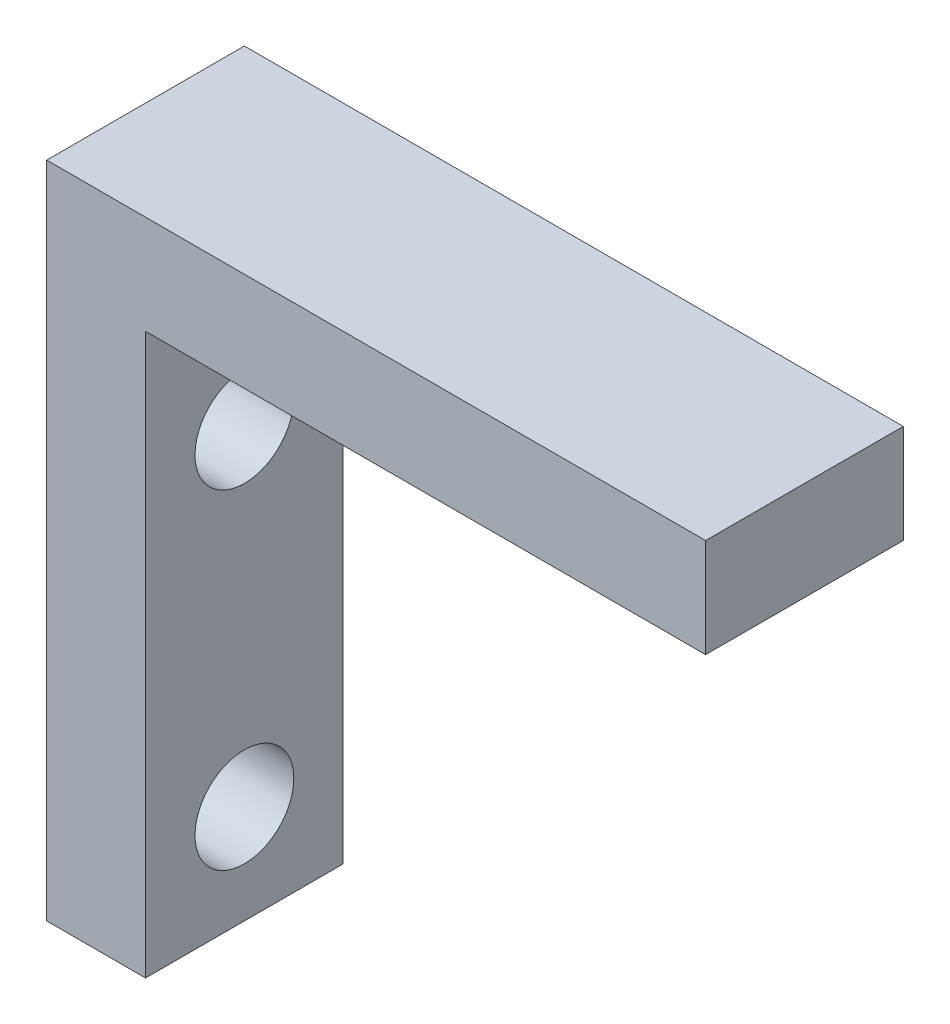
ISO-10303-21;
HEADER;
FILE_DESCRIPTION(('STEP AP214'),'2;1');
FILE_NAME('part.step','',(''),(''),'','','');
FILE_SCHEMA(('AUTOMOTIVE_DESIGN { 1 0 10303 214 1 1 1 1 }'));
ENDSEC;
DATA;
#1=APPLICATION_CONTEXT('core data for automotive mechanical design processes');
#2=APPLICATION_PROTOCOL_DEFINITION('international standard','automotive_design',2000,#1);
#3=PRODUCT_CONTEXT('',#1,'mechanical');
#4=PRODUCT('Part','Part','',(#3));
#5=PRODUCT_RELATED_PRODUCT_CATEGORY('part','',(#4));
#6=PRODUCT_DEFINITION_FORMATION('','',#4);
#7=PRODUCT_DEFINITION_CONTEXT('part definition',#1,'design');
#8=PRODUCT_DEFINITION('design','',#6,#7);
#9=PRODUCT_DEFINITION_SHAPE('','',#8);
#10=(LENGTH_UNIT() NAMED_UNIT(*) SI_UNIT(.MILLI.,.METRE.));
#11=(NAMED_UNIT(*) PLANE_ANGLE_UNIT() SI_UNIT($,.RADIAN.));
#12=(NAMED_UNIT(*) SI_UNIT($,.STERADIAN.) SOLID_ANGLE_UNIT());
#13=UNCERTAINTY_MEASURE_WITH_UNIT(LENGTH_MEASURE(1.E-05),#10,'distance_accuracy_value','');
#14=(GEOMETRIC_REPRESENTATION_CONTEXT(3) GLOBAL_UNCERTAINTY_ASSIGNED_CONTEXT((#13)) GLOBAL_UNIT_ASSIGNED_CONTEXT((#10,
#11,#12)) REPRESENTATION_CONTEXT('',''));
#15=CARTESIAN_POINT('',(0.,0.,0.));
#16=DIRECTION('',(0.,0.,1.));
#17=DIRECTION('',(1.,0.,0.));
#18=AXIS2_PLACEMENT_3D('',#15,#16,#17);
#19=CARTESIAN_POINT('',(0.,-3.,6.));
#20=DIRECTION('',(-1.,0.,0.));
#21=DIRECTION('',(0.,0.,1.));
#22=AXIS2_PLACEMENT_3D('',#19,#20,#21);
#23=PLANE('',#22);
#24=DIRECTION('',(0.,1.,0.));
#25=VECTOR('',#24,1.);
#26=CARTESIAN_POINT('',(0.,-3.,0.));
#27=LINE('',#26,#25);
#28=CARTESIAN_POINT('',(0.,-3.,0.));
#29=VERTEX_POINT('',#28);
#30=CARTESIAN_POINT('',(0.,0.,0.));
#31=VERTEX_POINT('',#30);
#32=EDGE_CURVE('E117',#29,#31,#27,.T.);
#33=ORIENTED_EDGE('',*,*,#32,.T.);
#34=DIRECTION('',(0.,0.,-1.));
#35=VECTOR('',#34,1.);
#36=CARTESIAN_POINT('',(0.,0.,6.));
#37=LINE('',#36,#35);
#38=CARTESIAN_POINT('',(0.,0.,6.));
#39=VERTEX_POINT('',#38);
#40=EDGE_CURVE('E11',#39,#31,#37,.T.);
#41=ORIENTED_EDGE('',*,*,#40,.F.);
#42=DIRECTION('',(0.,1.,0.));
#43=VECTOR('',#42,1.);
#44=CARTESIAN_POINT('',(0.,-3.,6.));
#45=LINE('',#44,#43);
#46=CARTESIAN_POINT('',(0.,-3.,6.));
#47=VERTEX_POINT('',#46);
#48=EDGE_CURVE('E128',#47,#39,#45,.T.);
#49=ORIENTED_EDGE('',*,*,#48,.F.);
#50=DIRECTION('',(0.,0.,-1.));
#51=VECTOR('',#50,1.);
#52=CARTESIAN_POINT('',(0.,-3.,6.));
#53=LINE('',#52,#51);
#54=EDGE_CURVE('E113',#47,#29,#53,.T.);
#55=ORIENTED_EDGE('',*,*,#54,.T.);
#56=EDGE_LOOP('',(#33,#41,#49,#55));
#57=FACE_BOUND('',#56,.T.);
#58=ADVANCED_FACE('F33',(#57),#23,.F.);
#59=CARTESIAN_POINT('',(0.,0.,6.));
#60=DIRECTION('',(0.,-1.,0.));
#61=DIRECTION('',(0.,0.,-1.));
#62=AXIS2_PLACEMENT_3D('',#59,#60,#61);
#63=PLANE('',#62);
#64=DIRECTION('',(-1.,0.,0.));
#65=VECTOR('',#64,1.);
#66=CARTESIAN_POINT('',(0.,0.,0.));
#67=LINE('',#66,#65);
#68=CARTESIAN_POINT('',(-20.,0.,0.));
#69=VERTEX_POINT('',#68);
#70=EDGE_CURVE('E120',#31,#69,#67,.T.);
#71=ORIENTED_EDGE('',*,*,#70,.T.);
#72=DIRECTION('',(0.,0.,-1.));
#73=VECTOR('',#72,1.);
#74=CARTESIAN_POINT('',(-20.,0.,6.));
#75=LINE('',#74,#73);
#76=CARTESIAN_POINT('',(-20.,0.,6.));
#77=VERTEX_POINT('',#76);
#78=EDGE_CURVE('E41',#77,#69,#75,.T.);
#79=ORIENTED_EDGE('',*,*,#78,.F.);
#80=DIRECTION('',(-1.,0.,0.));
#81=VECTOR('',#80,1.);
#82=CARTESIAN_POINT('',(0.,0.,6.));
#83=LINE('',#82,#81);
#84=EDGE_CURVE('E86',#39,#77,#83,.T.);
#85=ORIENTED_EDGE('',*,*,#84,.F.);
#86=ORIENTED_EDGE('',*,*,#40,.T.);
#87=EDGE_LOOP('',(#71,#79,#85,#86));
#88=FACE_BOUND('',#87,.T.);
#89=ADVANCED_FACE('F153',(#88),#63,.F.);
#90=CARTESIAN_POINT('',(-20.,0.,6.));
#91=DIRECTION('',(1.,0.,0.));
#92=DIRECTION('',(0.,1.,0.));
#93=AXIS2_PLACEMENT_3D('',#90,#91,#92);
#94=PLANE('',#93);
#95=CARTESIAN_POINT('',(-20.,-7.,3.));
#96=DIRECTION('',(-1.,0.,0.));
#97=DIRECTION('',(0.,-1.,0.));
#98=AXIS2_PLACEMENT_3D('',#95,#96,#97);
#99=CIRCLE('',#98,1.5);
#100=CARTESIAN_POINT('',(-20.,-8.5,3.));
#101=VERTEX_POINT('',#100);
#102=EDGE_CURVE('E220',#101,#101,#99,.T.);
#103=ORIENTED_EDGE('',*,*,#102,.F.);
#104=EDGE_LOOP('',(#103));
#105=FACE_BOUND('',#104,.T.);
#106=CARTESIAN_POINT('',(-20.,-17.,3.));
#107=DIRECTION('',(-1.,0.,0.));
#108=DIRECTION('',(0.,-1.,0.));
#109=AXIS2_PLACEMENT_3D('',#106,#107,#108);
#110=CIRCLE('',#109,1.5);
#111=CARTESIAN_POINT('',(-20.,-18.5,3.));
#112=VERTEX_POINT('',#111);
#113=EDGE_CURVE('E225',#112,#112,#110,.T.);
#114=ORIENTED_EDGE('',*,*,#113,.F.);
#115=EDGE_LOOP('',(#114));
#116=FACE_BOUND('',#115,.T.);
#117=DIRECTION('',(0.,-1.,0.));
#118=VECTOR('',#117,1.);
#119=CARTESIAN_POINT('',(-20.,0.,0.));
#120=LINE('',#119,#118);
#121=CARTESIAN_POINT('',(-20.,-20.,0.));
#122=VERTEX_POINT('',#121);
#123=EDGE_CURVE('E123',#69,#122,#120,.T.);
#124=ORIENTED_EDGE('',*,*,#123,.T.);
#125=DIRECTION('',(0.,0.,-1.));
#126=VECTOR('',#125,1.);
#127=CARTESIAN_POINT('',(-20.,-20.,6.));
#128=LINE('',#127,#126);
#129=CARTESIAN_POINT('',(-20.,-20.,6.));
#130=VERTEX_POINT('',#129);
#131=EDGE_CURVE('E108',#130,#122,#128,.T.);
#132=ORIENTED_EDGE('',*,*,#131,.F.);
#133=DIRECTION('',(0.,-1.,0.));
#134=VECTOR('',#133,1.);
#135=CARTESIAN_POINT('',(-20.,0.,6.));
#136=LINE('',#135,#134);
#137=EDGE_CURVE('E99',#77,#130,#136,.T.);
#138=ORIENTED_EDGE('',*,*,#137,.F.);
#139=ORIENTED_EDGE('',*,*,#78,.T.);
#140=EDGE_LOOP('',(#124,#132,#138,#139));
#141=FACE_BOUND('',#140,.T.);
#142=ADVANCED_FACE('F134',(#105,#116,#141),#94,.F.);
#143=CARTESIAN_POINT('',(-20.,-20.,6.));
#144=DIRECTION('',(0.,1.,0.));
#145=DIRECTION('',(0.,0.,1.));
#146=AXIS2_PLACEMENT_3D('',#143,#144,#145);
#147=PLANE('',#146);
#148=DIRECTION('',(1.,0.,0.));
#149=VECTOR('',#148,1.);
#150=CARTESIAN_POINT('',(-20.,-20.,0.));
#151=LINE('',#150,#149);
#152=CARTESIAN_POINT('',(-17.,-20.,0.));
#153=VERTEX_POINT('',#152);
#154=EDGE_CURVE('E107',#122,#153,#151,.T.);
#155=ORIENTED_EDGE('',*,*,#154,.T.);
#156=DIRECTION('',(0.,0.,-1.));
#157=VECTOR('',#156,1.);
#158=CARTESIAN_POINT('',(-17.,-20.,6.));
#159=LINE('',#158,#157);
#160=CARTESIAN_POINT('',(-17.,-20.,6.));
#161=VERTEX_POINT('',#160);
#162=EDGE_CURVE('E104',#161,#153,#159,.T.);
#163=ORIENTED_EDGE('',*,*,#162,.F.);
#164=DIRECTION('',(1.,0.,0.));
#165=VECTOR('',#164,1.);
#166=CARTESIAN_POINT('',(-20.,-20.,6.));
#167=LINE('',#166,#165);
#168=EDGE_CURVE('E93',#130,#161,#167,.T.);
#169=ORIENTED_EDGE('',*,*,#168,.F.);
#170=ORIENTED_EDGE('',*,*,#131,.T.);
#171=EDGE_LOOP('',(#155,#163,#169,#170));
#172=FACE_BOUND('',#171,.T.);
#173=ADVANCED_FACE('F105',(#172),#147,.F.);
#174=CARTESIAN_POINT('',(-17.,-20.,6.));
#175=DIRECTION('',(-1.,0.,0.));
#176=DIRECTION('',(0.,0.,1.));
#177=AXIS2_PLACEMENT_3D('',#174,#175,#176);
#178=PLANE('',#177);
#179=CARTESIAN_POINT('',(-17.,-7.,3.));
#180=DIRECTION('',(-1.,0.,0.));
#181=DIRECTION('',(0.,-1.,0.));
#182=AXIS2_PLACEMENT_3D('',#179,#180,#181);
#183=CIRCLE('',#182,1.5);
#184=CARTESIAN_POINT('',(-17.,-8.5,3.));
#185=VERTEX_POINT('',#184);
#186=EDGE_CURVE('E121',#185,#185,#183,.T.);
#187=ORIENTED_EDGE('',*,*,#186,.T.);
#188=EDGE_LOOP('',(#187));
#189=FACE_BOUND('',#188,.T.);
#190=CARTESIAN_POINT('',(-17.,-17.,3.));
#191=DIRECTION('',(-1.,0.,0.));
#192=DIRECTION('',(0.,-1.,0.));
#193=AXIS2_PLACEMENT_3D('',#190,#191,#192);
#194=CIRCLE('',#193,1.5);
#195=CARTESIAN_POINT('',(-17.,-18.5,3.));
#196=VERTEX_POINT('',#195);
#197=EDGE_CURVE('E221',#196,#196,#194,.T.);
#198=ORIENTED_EDGE('',*,*,#197,.T.);
#199=EDGE_LOOP('',(#198));
#200=FACE_BOUND('',#199,.T.);
#201=DIRECTION('',(0.,1.,0.));
#202=VECTOR('',#201,1.);
#203=CARTESIAN_POINT('',(-17.,-20.,0.));
#204=LINE('',#203,#202);
#205=CARTESIAN_POINT('',(-17.,-3.,0.));
#206=VERTEX_POINT('',#205);
#207=EDGE_CURVE('E72',#153,#206,#204,.T.);
#208=ORIENTED_EDGE('',*,*,#207,.T.);
#209=DIRECTION('',(0.,0.,-1.));
#210=VECTOR('',#209,1.);
#211=CARTESIAN_POINT('',(-17.,-3.,6.));
#212=LINE('',#211,#210);
#213=CARTESIAN_POINT('',(-17.,-3.,6.));
#214=VERTEX_POINT('',#213);
#215=EDGE_CURVE('E109',#214,#206,#212,.T.);
#216=ORIENTED_EDGE('',*,*,#215,.F.);
#217=DIRECTION('',(0.,1.,0.));
#218=VECTOR('',#217,1.);
#219=CARTESIAN_POINT('',(-17.,-20.,6.));
#220=LINE('',#219,#218);
#221=EDGE_CURVE('E97',#161,#214,#220,.T.);
#222=ORIENTED_EDGE('',*,*,#221,.F.);
#223=ORIENTED_EDGE('',*,*,#162,.T.);
#224=EDGE_LOOP('',(#208,#216,#222,#223));
#225=FACE_BOUND('',#224,.T.);
#226=ADVANCED_FACE('F111',(#189,#200,#225),#178,.F.);
#227=CARTESIAN_POINT('',(-17.,-3.,6.));
#228=DIRECTION('',(0.,1.,0.));
#229=DIRECTION('',(0.,0.,1.));
#230=AXIS2_PLACEMENT_3D('',#227,#228,#229);
#231=PLANE('',#230);
#232=DIRECTION('',(1.,0.,0.));
#233=VECTOR('',#232,1.);
#234=CARTESIAN_POINT('',(-17.,-3.,0.));
#235=LINE('',#234,#233);
#236=EDGE_CURVE('E78',#206,#29,#235,.T.);
#237=ORIENTED_EDGE('',*,*,#236,.T.);
#238=ORIENTED_EDGE('',*,*,#54,.F.);
#239=DIRECTION('',(1.,0.,0.));
#240=VECTOR('',#239,1.);
#241=CARTESIAN_POINT('',(-17.,-3.,6.));
#242=LINE('',#241,#240);
#243=EDGE_CURVE('E49',#214,#47,#242,.T.);
#244=ORIENTED_EDGE('',*,*,#243,.F.);
#245=ORIENTED_EDGE('',*,*,#215,.T.);
#246=EDGE_LOOP('',(#237,#238,#244,#245));
#247=FACE_BOUND('',#246,.T.);
#248=ADVANCED_FACE('F141',(#247),#231,.F.);
#249=CARTESIAN_POINT('',(0.,0.,6.));
#250=DIRECTION('',(0.,0.,1.));
#251=DIRECTION('',(1.,0.,0.));
#252=AXIS2_PLACEMENT_3D('',#249,#250,#251);
#253=PLANE('',#252);
#254=ORIENTED_EDGE('',*,*,#48,.T.);
#255=ORIENTED_EDGE('',*,*,#84,.T.);
#256=ORIENTED_EDGE('',*,*,#137,.T.);
#257=ORIENTED_EDGE('',*,*,#168,.T.);
#258=ORIENTED_EDGE('',*,*,#221,.T.);
#259=ORIENTED_EDGE('',*,*,#243,.T.);
#260=EDGE_LOOP('',(#254,#255,#256,#257,#258,#259));
#261=FACE_BOUND('',#260,.T.);
#262=ADVANCED_FACE('F95',(#261),#253,.T.);
#263=CARTESIAN_POINT('',(0.,0.,0.));
#264=DIRECTION('',(0.,0.,1.));
#265=DIRECTION('',(1.,0.,0.));
#266=AXIS2_PLACEMENT_3D('',#263,#264,#265);
#267=PLANE('',#266);
#268=ORIENTED_EDGE('',*,*,#32,.F.);
#269=ORIENTED_EDGE('',*,*,#236,.F.);
#270=ORIENTED_EDGE('',*,*,#207,.F.);
#271=ORIENTED_EDGE('',*,*,#154,.F.);
#272=ORIENTED_EDGE('',*,*,#123,.F.);
#273=ORIENTED_EDGE('',*,*,#70,.F.);
#274=EDGE_LOOP('',(#268,#269,#270,#271,#272,#273));
#275=FACE_BOUND('',#274,.T.);
#276=ADVANCED_FACE('F137',(#275),#267,.F.);
#277=CARTESIAN_POINT('',(-17.,-17.,3.));
#278=DIRECTION('',(-1.,0.,0.));
#279=DIRECTION('',(0.,-1.,0.));
#280=AXIS2_PLACEMENT_3D('',#277,#278,#279);
#281=CYLINDRICAL_SURFACE('',#280,1.5);
#282=ORIENTED_EDGE('',*,*,#197,.F.);
#283=EDGE_LOOP('',(#282));
#284=FACE_BOUND('',#283,.T.);
#285=ORIENTED_EDGE('',*,*,#113,.T.);
#286=EDGE_LOOP('',(#285));
#287=FACE_BOUND('',#286,.T.);
#288=ADVANCED_FACE('F181',(#284,#287),#281,.F.);
#289=CARTESIAN_POINT('',(-17.,-7.,3.));
#290=DIRECTION('',(-1.,0.,0.));
#291=DIRECTION('',(0.,-1.,0.));
#292=AXIS2_PLACEMENT_3D('',#289,#290,#291);
#293=CYLINDRICAL_SURFACE('',#292,1.5);
#294=ORIENTED_EDGE('',*,*,#186,.F.);
#295=EDGE_LOOP('',(#294));
#296=FACE_BOUND('',#295,.T.);
#297=ORIENTED_EDGE('',*,*,#102,.T.);
#298=EDGE_LOOP('',(#297));
#299=FACE_BOUND('',#298,.T.);
#300=ADVANCED_FACE('F186',(#296,#299),#293,.F.);
#301=CLOSED_SHELL('',(#58,#89,#142,#173,#226,#248,#262,#276,#288,#300));
#302=MANIFOLD_SOLID_BREP('B2',#301);
#303=ADVANCED_BREP_SHAPE_REPRESENTATION('',(#18,#302),#14);
#304=SHAPE_DEFINITION_REPRESENTATION(#9,#303);
ENDSEC;
END-ISO-10303-21;
